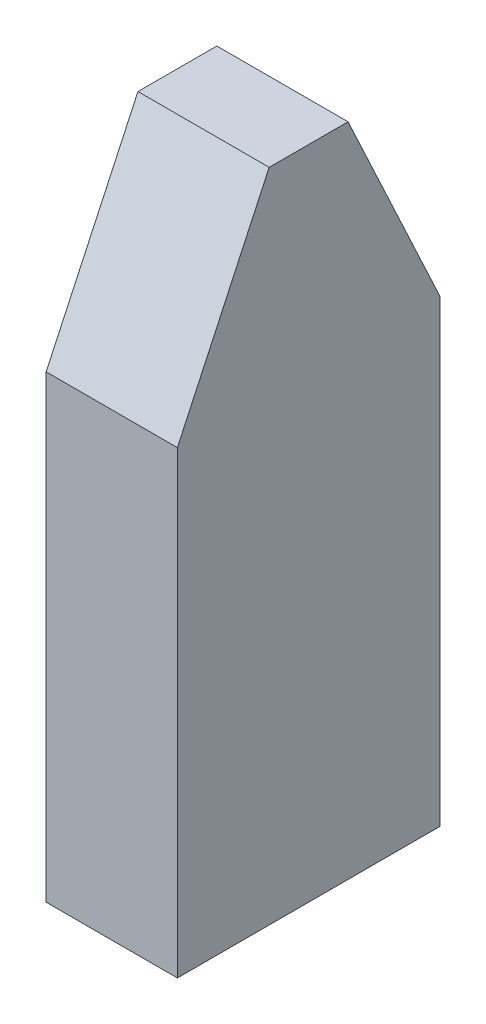
ISO-10303-21;
HEADER;
FILE_DESCRIPTION(('STEP AP214'),'2;1');
FILE_NAME('part.step','',(''),(''),'','','');
FILE_SCHEMA(('AUTOMOTIVE_DESIGN { 1 0 10303 214 1 1 1 1 }'));
ENDSEC;
DATA;
#1=APPLICATION_CONTEXT('core data for automotive mechanical design processes');
#2=APPLICATION_PROTOCOL_DEFINITION('international standard','automotive_design',2000,#1);
#3=PRODUCT_CONTEXT('',#1,'mechanical');
#4=PRODUCT('Part','Part','',(#3));
#5=PRODUCT_RELATED_PRODUCT_CATEGORY('part','',(#4));
#6=PRODUCT_DEFINITION_FORMATION('','',#4);
#7=PRODUCT_DEFINITION_CONTEXT('part definition',#1,'design');
#8=PRODUCT_DEFINITION('design','',#6,#7);
#9=PRODUCT_DEFINITION_SHAPE('','',#8);
#10=(LENGTH_UNIT() NAMED_UNIT(*) SI_UNIT(.MILLI.,.METRE.));
#11=(NAMED_UNIT(*) PLANE_ANGLE_UNIT() SI_UNIT($,.RADIAN.));
#12=(NAMED_UNIT(*) SI_UNIT($,.STERADIAN.) SOLID_ANGLE_UNIT());
#13=UNCERTAINTY_MEASURE_WITH_UNIT(LENGTH_MEASURE(1.E-05),#10,'distance_accuracy_value','');
#14=(GEOMETRIC_REPRESENTATION_CONTEXT(3) GLOBAL_UNCERTAINTY_ASSIGNED_CONTEXT((#13)) GLOBAL_UNIT_ASSIGNED_CONTEXT((#10,
#11,#12)) REPRESENTATION_CONTEXT('',''));
#15=CARTESIAN_POINT('',(0.,0.,0.));
#16=DIRECTION('',(0.,0.,1.));
#17=DIRECTION('',(1.,0.,0.));
#18=AXIS2_PLACEMENT_3D('',#15,#16,#17);
#19=CARTESIAN_POINT('',(-5.,50.,-10.));
#20=DIRECTION('',(1.,0.,0.));
#21=DIRECTION('',(0.,0.,-1.));
#22=AXIS2_PLACEMENT_3D('',#19,#20,#21);
#23=PLANE('',#22);
#24=DIRECTION('',(0.,0.,1.));
#25=VECTOR('',#24,1.);
#26=CARTESIAN_POINT('',(-5.,50.,-10.));
#27=LINE('',#26,#25);
#28=CARTESIAN_POINT('',(-5.,50.,-3.00538512767501));
#29=VERTEX_POINT('',#28);
#30=CARTESIAN_POINT('',(-5.,50.,3.00538512767501));
#31=VERTEX_POINT('',#30);
#32=EDGE_CURVE('E117',#29,#31,#27,.T.);
#33=ORIENTED_EDGE('',*,*,#32,.F.);
#34=DIRECTION('',(0.,-0.906307787036651,-0.422618261740697));
#35=VECTOR('',#34,1.);
#36=CARTESIAN_POINT('',(-5.,50.,-3.00538512767501));
#37=LINE('',#36,#35);
#38=CARTESIAN_POINT('',(-5.,34.9999999999999,-10.));
#39=VERTEX_POINT('',#38);
#40=EDGE_CURVE('E56',#29,#39,#37,.T.);
#41=ORIENTED_EDGE('',*,*,#40,.T.);
#42=DIRECTION('',(0.,-1.,0.));
#43=VECTOR('',#42,1.);
#44=CARTESIAN_POINT('',(-5.,50.,-10.));
#45=LINE('',#44,#43);
#46=CARTESIAN_POINT('',(-5.,0.,-10.));
#47=VERTEX_POINT('',#46);
#48=EDGE_CURVE('E107',#39,#47,#45,.T.);
#49=ORIENTED_EDGE('',*,*,#48,.T.);
#50=DIRECTION('',(0.,0.,1.));
#51=VECTOR('',#50,1.);
#52=CARTESIAN_POINT('',(-5.,0.,-10.));
#53=LINE('',#52,#51);
#54=CARTESIAN_POINT('',(-5.,0.,10.));
#55=VERTEX_POINT('',#54);
#56=EDGE_CURVE('E103',#47,#55,#53,.T.);
#57=ORIENTED_EDGE('',*,*,#56,.T.);
#58=DIRECTION('',(0.,-1.,0.));
#59=VECTOR('',#58,1.);
#60=CARTESIAN_POINT('',(-5.,50.,10.));
#61=LINE('',#60,#59);
#62=CARTESIAN_POINT('',(-5.,34.9999999999999,10.));
#63=VERTEX_POINT('',#62);
#64=EDGE_CURVE('E85',#63,#55,#61,.T.);
#65=ORIENTED_EDGE('',*,*,#64,.F.);
#66=DIRECTION('',(0.,0.906307787036651,-0.422618261740697));
#67=VECTOR('',#66,1.);
#68=CARTESIAN_POINT('',(-5.,50.,3.00538512767501));
#69=LINE('',#68,#67);
#70=EDGE_CURVE('E127',#63,#31,#69,.T.);
#71=ORIENTED_EDGE('',*,*,#70,.T.);
#72=EDGE_LOOP('',(#33,#41,#49,#57,#65,#71));
#73=FACE_BOUND('',#72,.T.);
#74=ADVANCED_FACE('F34',(#73),#23,.F.);
#75=CARTESIAN_POINT('',(-5.,50.,10.));
#76=DIRECTION('',(0.,0.,-1.));
#77=DIRECTION('',(-1.,0.,0.));
#78=AXIS2_PLACEMENT_3D('',#75,#76,#77);
#79=PLANE('',#78);
#80=DIRECTION('',(0.,-1.,0.));
#81=VECTOR('',#80,1.);
#82=CARTESIAN_POINT('',(5.,50.,10.));
#83=LINE('',#82,#81);
#84=CARTESIAN_POINT('',(5.,34.9999999999999,10.));
#85=VERTEX_POINT('',#84);
#86=CARTESIAN_POINT('',(5.,0.,10.));
#87=VERTEX_POINT('',#86);
#88=EDGE_CURVE('E97',#85,#87,#83,.T.);
#89=ORIENTED_EDGE('',*,*,#88,.F.);
#90=DIRECTION('',(-1.,0.,0.));
#91=VECTOR('',#90,1.);
#92=CARTESIAN_POINT('',(-5.,34.9999999999999,10.));
#93=LINE('',#92,#91);
#94=EDGE_CURVE('E92',#85,#63,#93,.T.);
#95=ORIENTED_EDGE('',*,*,#94,.T.);
#96=ORIENTED_EDGE('',*,*,#64,.T.);
#97=DIRECTION('',(1.,0.,0.));
#98=VECTOR('',#97,1.);
#99=CARTESIAN_POINT('',(-5.,0.,10.));
#100=LINE('',#99,#98);
#101=EDGE_CURVE('E89',#55,#87,#100,.T.);
#102=ORIENTED_EDGE('',*,*,#101,.T.);
#103=EDGE_LOOP('',(#89,#95,#96,#102));
#104=FACE_BOUND('',#103,.T.);
#105=ADVANCED_FACE('F88',(#104),#79,.F.);
#106=CARTESIAN_POINT('',(5.,50.,-10.));
#107=DIRECTION('',(-1.,0.,0.));
#108=DIRECTION('',(0.,0.,1.));
#109=AXIS2_PLACEMENT_3D('',#106,#107,#108);
#110=PLANE('',#109);
#111=DIRECTION('',(0.,-1.,0.));
#112=VECTOR('',#111,1.);
#113=CARTESIAN_POINT('',(5.,50.,-10.));
#114=LINE('',#113,#112);
#115=CARTESIAN_POINT('',(5.,34.9999999999999,-10.));
#116=VERTEX_POINT('',#115);
#117=CARTESIAN_POINT('',(5.,0.,-10.));
#118=VERTEX_POINT('',#117);
#119=EDGE_CURVE('E119',#116,#118,#114,.T.);
#120=ORIENTED_EDGE('',*,*,#119,.F.);
#121=DIRECTION('',(0.,0.906307787036651,0.422618261740697));
#122=VECTOR('',#121,1.);
#123=CARTESIAN_POINT('',(5.,50.,-3.00538512767501));
#124=LINE('',#123,#122);
#125=CARTESIAN_POINT('',(5.,50.,-3.00538512767501));
#126=VERTEX_POINT('',#125);
#127=EDGE_CURVE('E11',#116,#126,#124,.T.);
#128=ORIENTED_EDGE('',*,*,#127,.T.);
#129=DIRECTION('',(0.,0.,-1.));
#130=VECTOR('',#129,1.);
#131=CARTESIAN_POINT('',(5.,50.,-10.));
#132=LINE('',#131,#130);
#133=CARTESIAN_POINT('',(5.,50.,3.00538512767501));
#134=VERTEX_POINT('',#133);
#135=EDGE_CURVE('E111',#134,#126,#132,.T.);
#136=ORIENTED_EDGE('',*,*,#135,.F.);
#137=DIRECTION('',(0.,-0.906307787036651,0.422618261740697));
#138=VECTOR('',#137,1.);
#139=CARTESIAN_POINT('',(5.,50.,3.00538512767501));
#140=LINE('',#139,#138);
#141=EDGE_CURVE('E124',#134,#85,#140,.T.);
#142=ORIENTED_EDGE('',*,*,#141,.T.);
#143=ORIENTED_EDGE('',*,*,#88,.T.);
#144=DIRECTION('',(0.,0.,-1.));
#145=VECTOR('',#144,1.);
#146=CARTESIAN_POINT('',(5.,0.,-10.));
#147=LINE('',#146,#145);
#148=EDGE_CURVE('E105',#87,#118,#147,.T.);
#149=ORIENTED_EDGE('',*,*,#148,.T.);
#150=EDGE_LOOP('',(#120,#128,#136,#142,#143,#149));
#151=FACE_BOUND('',#150,.T.);
#152=ADVANCED_FACE('F143',(#151),#110,.F.);
#153=CARTESIAN_POINT('',(-5.,50.,-10.));
#154=DIRECTION('',(0.,0.,1.));
#155=DIRECTION('',(1.,0.,0.));
#156=AXIS2_PLACEMENT_3D('',#153,#154,#155);
#157=PLANE('',#156);
#158=ORIENTED_EDGE('',*,*,#48,.F.);
#159=DIRECTION('',(1.,0.,0.));
#160=VECTOR('',#159,1.);
#161=CARTESIAN_POINT('',(5.,34.9999999999999,-10.));
#162=LINE('',#161,#160);
#163=EDGE_CURVE('E42',#39,#116,#162,.T.);
#164=ORIENTED_EDGE('',*,*,#163,.T.);
#165=ORIENTED_EDGE('',*,*,#119,.T.);
#166=DIRECTION('',(-1.,0.,0.));
#167=VECTOR('',#166,1.);
#168=CARTESIAN_POINT('',(-5.,0.,-10.));
#169=LINE('',#168,#167);
#170=EDGE_CURVE('E115',#118,#47,#169,.T.);
#171=ORIENTED_EDGE('',*,*,#170,.T.);
#172=EDGE_LOOP('',(#158,#164,#165,#171));
#173=FACE_BOUND('',#172,.T.);
#174=ADVANCED_FACE('F158',(#173),#157,.F.);
#175=CARTESIAN_POINT('',(-5.,50.,10.));
#176=DIRECTION('',(0.,1.,0.));
#177=DIRECTION('',(0.,0.,1.));
#178=AXIS2_PLACEMENT_3D('',#175,#176,#177);
#179=PLANE('',#178);
#180=ORIENTED_EDGE('',*,*,#135,.T.);
#181=DIRECTION('',(-1.,0.,0.));
#182=VECTOR('',#181,1.);
#183=CARTESIAN_POINT('',(-5.,50.,-3.00538512767501));
#184=LINE('',#183,#182);
#185=EDGE_CURVE('E129',#126,#29,#184,.T.);
#186=ORIENTED_EDGE('',*,*,#185,.T.);
#187=ORIENTED_EDGE('',*,*,#32,.T.);
#188=DIRECTION('',(1.,0.,0.));
#189=VECTOR('',#188,1.);
#190=CARTESIAN_POINT('',(5.,50.,3.00538512767501));
#191=LINE('',#190,#189);
#192=EDGE_CURVE('E96',#31,#134,#191,.T.);
#193=ORIENTED_EDGE('',*,*,#192,.T.);
#194=EDGE_LOOP('',(#180,#186,#187,#193));
#195=FACE_BOUND('',#194,.T.);
#196=ADVANCED_FACE('F135',(#195),#179,.T.);
#197=CARTESIAN_POINT('',(-5.,0.,10.));
#198=DIRECTION('',(0.,1.,0.));
#199=DIRECTION('',(0.,0.,1.));
#200=AXIS2_PLACEMENT_3D('',#197,#198,#199);
#201=PLANE('',#200);
#202=ORIENTED_EDGE('',*,*,#56,.F.);
#203=ORIENTED_EDGE('',*,*,#170,.F.);
#204=ORIENTED_EDGE('',*,*,#148,.F.);
#205=ORIENTED_EDGE('',*,*,#101,.F.);
#206=EDGE_LOOP('',(#202,#203,#204,#205));
#207=FACE_BOUND('',#206,.T.);
#208=ADVANCED_FACE('F101',(#207),#201,.F.);
#209=CARTESIAN_POINT('',(-5.,50.,3.00538512767501));
#210=DIRECTION('',(0.,0.422618261740697,0.906307787036651));
#211=DIRECTION('',(0.,-0.906307787036651,0.422618261740697));
#212=AXIS2_PLACEMENT_3D('',#209,#210,#211);
#213=PLANE('',#212);
#214=ORIENTED_EDGE('',*,*,#70,.F.);
#215=ORIENTED_EDGE('',*,*,#94,.F.);
#216=ORIENTED_EDGE('',*,*,#141,.F.);
#217=ORIENTED_EDGE('',*,*,#192,.F.);
#218=EDGE_LOOP('',(#214,#215,#216,#217));
#219=FACE_BOUND('',#218,.T.);
#220=ADVANCED_FACE('F141',(#219),#213,.T.);
#221=CARTESIAN_POINT('',(-5.,50.,-3.00538512767501));
#222=DIRECTION('',(0.,0.422618261740697,-0.906307787036651));
#223=DIRECTION('',(0.,0.906307787036651,0.422618261740697));
#224=AXIS2_PLACEMENT_3D('',#221,#222,#223);
#225=PLANE('',#224);
#226=ORIENTED_EDGE('',*,*,#127,.F.);
#227=ORIENTED_EDGE('',*,*,#163,.F.);
#228=ORIENTED_EDGE('',*,*,#40,.F.);
#229=ORIENTED_EDGE('',*,*,#185,.F.);
#230=EDGE_LOOP('',(#226,#227,#228,#229));
#231=FACE_BOUND('',#230,.T.);
#232=ADVANCED_FACE('F36',(#231),#225,.T.);
#233=CLOSED_SHELL('',(#74,#105,#152,#174,#196,#208,#220,#232));
#234=MANIFOLD_SOLID_BREP('B2',#233);
#235=ADVANCED_BREP_SHAPE_REPRESENTATION('',(#18,#234),#14);
#236=SHAPE_DEFINITION_REPRESENTATION(#9,#235);
ENDSEC;
END-ISO-10303-21;
